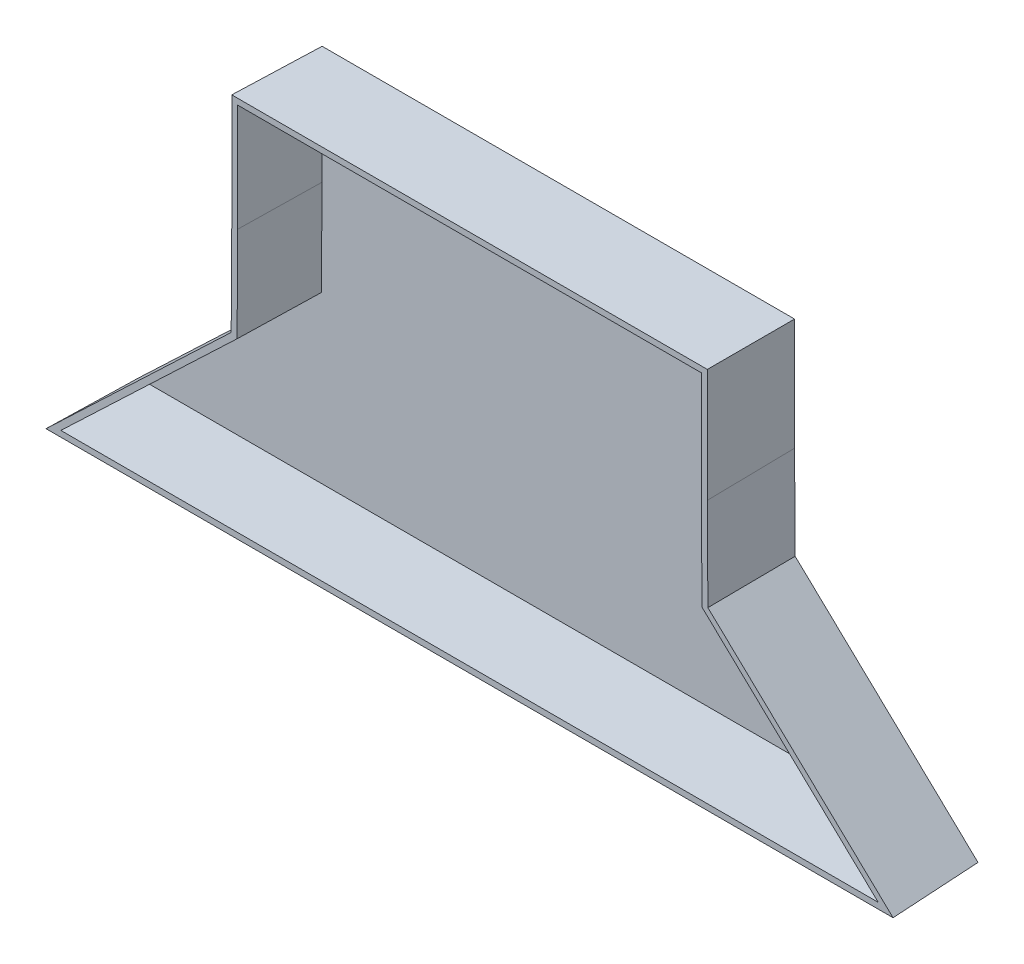
ISO-10303-21;
HEADER;
FILE_DESCRIPTION(('STEP AP214'),'2;1');
FILE_NAME('part.step','',(''),(''),'','','');
FILE_SCHEMA(('AUTOMOTIVE_DESIGN { 1 0 10303 214 1 1 1 1 }'));
ENDSEC;
DATA;
#1=APPLICATION_CONTEXT('core data for automotive mechanical design processes');
#2=APPLICATION_PROTOCOL_DEFINITION('international standard','automotive_design',2000,#1);
#3=PRODUCT_CONTEXT('',#1,'mechanical');
#4=PRODUCT('Part','Part','',(#3));
#5=PRODUCT_RELATED_PRODUCT_CATEGORY('part','',(#4));
#6=PRODUCT_DEFINITION_FORMATION('','',#4);
#7=PRODUCT_DEFINITION_CONTEXT('part definition',#1,'design');
#8=PRODUCT_DEFINITION('design','',#6,#7);
#9=PRODUCT_DEFINITION_SHAPE('','',#8);
#10=(LENGTH_UNIT() NAMED_UNIT(*) SI_UNIT(.MILLI.,.METRE.));
#11=(NAMED_UNIT(*) PLANE_ANGLE_UNIT() SI_UNIT($,.RADIAN.));
#12=(NAMED_UNIT(*) SI_UNIT($,.STERADIAN.) SOLID_ANGLE_UNIT());
#13=UNCERTAINTY_MEASURE_WITH_UNIT(LENGTH_MEASURE(1.E-05),#10,'distance_accuracy_value','');
#14=(GEOMETRIC_REPRESENTATION_CONTEXT(3) GLOBAL_UNCERTAINTY_ASSIGNED_CONTEXT((#13)) GLOBAL_UNIT_ASSIGNED_CONTEXT((#10,
#11,#12)) REPRESENTATION_CONTEXT('',''));
#15=CARTESIAN_POINT('',(0.,0.,0.));
#16=DIRECTION('',(0.,0.,1.));
#17=DIRECTION('',(1.,0.,0.));
#18=AXIS2_PLACEMENT_3D('',#15,#16,#17);
#19=CARTESIAN_POINT('',(0.,5.54139653256378,0.));
#20=DIRECTION('',(0.,-0.999847695156391,-0.0174524064372836));
#21=DIRECTION('',(0.,0.0174524064372836,-0.999847695156391));
#22=AXIS2_PLACEMENT_3D('',#19,#20,#21);
#23=PLANE('',#22);
#24=DIRECTION('',(1.,0.,0.));
#25=VECTOR('',#24,1.);
#26=CARTESIAN_POINT('',(0.,5.54139653256378,0.));
#27=LINE('',#26,#25);
#28=CARTESIAN_POINT('',(23.7821540360607,5.54139653256379,0.));
#29=VERTEX_POINT('',#28);
#30=CARTESIAN_POINT('',(165.552936780201,5.5413965325638,0.));
#31=VERTEX_POINT('',#30);
#32=EDGE_CURVE('E164',#29,#31,#27,.T.);
#33=ORIENTED_EDGE('',*,*,#32,.T.);
#34=DIRECTION('',(0.0436637861357693,-0.0174357617648877,0.998894122513476));
#35=VECTOR('',#34,1.);
#36=CARTESIAN_POINT('',(165.237305765479,5.66743386613772,-7.22067400449202));
#37=LINE('',#36,#35);
#38=CARTESIAN_POINT('',(166.208618676084,5.27957055864056,15.));
#39=VERTEX_POINT('',#38);
#40=EDGE_CURVE('E11',#39,#31,#37,.F.);
#41=ORIENTED_EDGE('',*,*,#40,.F.);
#42=DIRECTION('',(-1.,0.,0.));
#43=VECTOR('',#42,1.);
#44=CARTESIAN_POINT('',(0.,5.27957055864052,15.));
#45=LINE('',#44,#43);
#46=CARTESIAN_POINT('',(23.1264721401771,5.27957055864052,15.));
#47=VERTEX_POINT('',#46);
#48=EDGE_CURVE('E245',#47,#39,#45,.F.);
#49=ORIENTED_EDGE('',*,*,#48,.F.);
#50=DIRECTION('',(0.0436637861357693,0.0174357617648877,-0.998894122513476));
#51=VECTOR('',#50,1.);
#52=CARTESIAN_POINT('',(23.7368127358297,5.52329090822607,1.03727052360901));
#53=LINE('',#52,#51);
#54=EDGE_CURVE('E247',#47,#29,#53,.T.);
#55=ORIENTED_EDGE('',*,*,#54,.T.);
#56=EDGE_LOOP('',(#33,#41,#49,#55));
#57=FACE_BOUND('',#56,.T.);
#58=ADVANCED_FACE('F39',(#57),#23,.T.);
#59=CARTESIAN_POINT('',(81.3137707494737,85.5806071155987,0.));
#60=DIRECTION('',(0.688698845925641,0.72483743910634,-0.0174524064372836));
#61=DIRECTION('',(-0.72494785217559,0.688803754073683,0.));
#62=AXIS2_PLACEMENT_3D('',#59,#60,#61);
#63=PLANE('',#62);
#64=DIRECTION('',(0.72494785217559,-0.688803754073683,0.));
#65=VECTOR('',#64,1.);
#66=CARTESIAN_POINT('',(81.3137707494737,85.5806071155987,0.));
#67=LINE('',#66,#65);
#68=CARTESIAN_POINT('',(134.667545408131,34.8869190543189,0.));
#69=VERTEX_POINT('',#68);
#70=EDGE_CURVE('E227',#69,#31,#67,.T.);
#71=ORIENTED_EDGE('',*,*,#70,.F.);
#72=DIRECTION('',(0.0174049854885636,0.007536136230184,0.999820120387094));
#73=VECTOR('',#72,1.);
#74=CARTESIAN_POINT('',(134.663145120395,34.8850137859777,-0.25277218511028));
#75=LINE('',#74,#73);
#76=CARTESIAN_POINT('',(134.928667160939,34.9999814353889,15.));
#77=VERTEX_POINT('',#76);
#78=EDGE_CURVE('E48',#77,#69,#75,.F.);
#79=ORIENTED_EDGE('',*,*,#78,.F.);
#80=DIRECTION('',(0.72494785217559,-0.688803754073683,0.));
#81=VECTOR('',#80,1.);
#82=CARTESIAN_POINT('',(81.494117463226,85.7704172930381,15.));
#83=LINE('',#82,#81);
#84=EDGE_CURVE('E263',#77,#39,#83,.T.);
#85=ORIENTED_EDGE('',*,*,#84,.T.);
#86=ORIENTED_EDGE('',*,*,#40,.T.);
#87=EDGE_LOOP('',(#71,#79,#85,#86));
#88=FACE_BOUND('',#87,.T.);
#89=ADVANCED_FACE('F41',(#88),#63,.T.);
#90=CARTESIAN_POINT('',(134.881122806116,0.846269372514969,0.));
#91=DIRECTION('',(0.9998280160246,0.00627310783111053,-0.0174524064372836));
#92=DIRECTION('',(-0.0174527498399369,0.,-0.999847689162217));
#93=AXIS2_PLACEMENT_3D('',#90,#91,#92);
#94=PLANE('',#93);
#95=DIRECTION('',(-0.00627406340135567,0.999980317870525,0.));
#96=VECTOR('',#95,1.);
#97=CARTESIAN_POINT('',(134.881122806116,0.846269372514969,0.));
#98=LINE('',#97,#96);
#99=CARTESIAN_POINT('',(134.568658858887,50.6477739612299,0.));
#100=VERTEX_POINT('',#99);
#101=EDGE_CURVE('E230',#69,#100,#98,.T.);
#102=ORIENTED_EDGE('',*,*,#101,.T.);
#103=DIRECTION('',(-0.0174524064111269,-5.47492909557997E-05,-0.999847693657877));
#104=VECTOR('',#103,1.);
#105=CARTESIAN_POINT('',(134.568706445504,50.6477741105114,0.00272623544489111));
#106=LINE('',#105,#104);
#107=CARTESIAN_POINT('',(134.83048483281,50.6485953256926,15.));
#108=VERTEX_POINT('',#107);
#109=EDGE_CURVE('E258',#108,#100,#106,.T.);
#110=ORIENTED_EDGE('',*,*,#109,.F.);
#111=DIRECTION('',(0.00627406340135566,-0.999980317870525,0.));
#112=VECTOR('',#111,1.);
#113=CARTESIAN_POINT('',(135.142943626746,0.847912085275486,15.));
#114=LINE('',#113,#112);
#115=EDGE_CURVE('E266',#77,#108,#114,.F.);
#116=ORIENTED_EDGE('',*,*,#115,.F.);
#117=ORIENTED_EDGE('',*,*,#78,.T.);
#118=EDGE_LOOP('',(#102,#110,#116,#117));
#119=FACE_BOUND('',#118,.T.);
#120=ADVANCED_FACE('F303',(#119),#94,.T.);
#121=CARTESIAN_POINT('',(134.568658858887,0.,0.));
#122=DIRECTION('',(0.999847695156391,0.,-0.0174524064372836));
#123=DIRECTION('',(-0.0174524064372836,0.,-0.999847695156391));
#124=AXIS2_PLACEMENT_3D('',#121,#122,#123);
#125=PLANE('',#124);
#126=DIRECTION('',(0.,1.,0.));
#127=VECTOR('',#126,1.);
#128=CARTESIAN_POINT('',(134.568658858887,0.,0.));
#129=LINE('',#128,#127);
#130=CARTESIAN_POINT('',(134.568658858887,69.5413965325638,0.));
#131=VERTEX_POINT('',#130);
#132=EDGE_CURVE('E232',#100,#131,#129,.T.);
#133=ORIENTED_EDGE('',*,*,#132,.T.);
#134=DIRECTION('',(0.0174497491606827,0.0174497491606827,0.999695459881887));
#135=VECTOR('',#134,1.);
#136=CARTESIAN_POINT('',(134.547483938571,69.5202216122475,-1.21311037245689));
#137=LINE('',#136,#135);
#138=CARTESIAN_POINT('',(134.83048483281,69.8032225064871,15.));
#139=VERTEX_POINT('',#138);
#140=EDGE_CURVE('E256',#139,#131,#137,.F.);
#141=ORIENTED_EDGE('',*,*,#140,.F.);
#142=DIRECTION('',(0.,-1.,0.));
#143=VECTOR('',#142,1.);
#144=CARTESIAN_POINT('',(134.83048483281,0.,15.));
#145=LINE('',#144,#143);
#146=EDGE_CURVE('E268',#108,#139,#145,.F.);
#147=ORIENTED_EDGE('',*,*,#146,.F.);
#148=ORIENTED_EDGE('',*,*,#109,.T.);
#149=EDGE_LOOP('',(#133,#141,#147,#148));
#150=FACE_BOUND('',#149,.T.);
#151=ADVANCED_FACE('F308',(#150),#125,.T.);
#152=CARTESIAN_POINT('',(0.,69.5413965325638,0.));
#153=DIRECTION('',(0.,0.999847695156391,-0.0174524064372836));
#154=DIRECTION('',(0.,0.0174524064372836,0.999847695156391));
#155=AXIS2_PLACEMENT_3D('',#152,#153,#154);
#156=PLANE('',#155);
#157=DIRECTION('',(1.,0.,0.));
#158=VECTOR('',#157,1.);
#159=CARTESIAN_POINT('',(0.,69.5413965325638,0.));
#160=LINE('',#159,#158);
#161=CARTESIAN_POINT('',(54.7664319573739,69.5413965325638,0.));
#162=VERTEX_POINT('',#161);
#163=EDGE_CURVE('E235',#162,#131,#160,.T.);
#164=ORIENTED_EDGE('',*,*,#163,.F.);
#165=DIRECTION('',(0.0174497491606828,-0.0174497491606827,-0.999695459881887));
#166=VECTOR('',#165,1.);
#167=CARTESIAN_POINT('',(54.7876068776903,69.5202216122475,-1.21311037245689));
#168=LINE('',#167,#166);
#169=CARTESIAN_POINT('',(54.5046059834507,69.8032225064871,15.));
#170=VERTEX_POINT('',#169);
#171=EDGE_CURVE('E254',#170,#162,#168,.T.);
#172=ORIENTED_EDGE('',*,*,#171,.F.);
#173=DIRECTION('',(1.,0.,0.));
#174=VECTOR('',#173,1.);
#175=CARTESIAN_POINT('',(0.,69.8032225064871,15.));
#176=LINE('',#175,#174);
#177=EDGE_CURVE('E270',#170,#139,#176,.T.);
#178=ORIENTED_EDGE('',*,*,#177,.T.);
#179=ORIENTED_EDGE('',*,*,#140,.T.);
#180=EDGE_LOOP('',(#164,#172,#178,#179));
#181=FACE_BOUND('',#180,.T.);
#182=ADVANCED_FACE('F310',(#181),#156,.T.);
#183=CARTESIAN_POINT('',(54.766431957374,0.,0.));
#184=DIRECTION('',(-0.999847695156391,0.,-0.0174524064372836));
#185=DIRECTION('',(-0.0174524064372836,0.,0.999847695156391));
#186=AXIS2_PLACEMENT_3D('',#183,#184,#185);
#187=PLANE('',#186);
#188=DIRECTION('',(0.,1.,0.));
#189=VECTOR('',#188,1.);
#190=CARTESIAN_POINT('',(54.766431957374,0.,0.));
#191=LINE('',#190,#189);
#192=CARTESIAN_POINT('',(54.7664319573739,50.6477739612299,0.));
#193=VERTEX_POINT('',#192);
#194=EDGE_CURVE('E238',#193,#162,#191,.T.);
#195=ORIENTED_EDGE('',*,*,#194,.F.);
#196=DIRECTION('',(0.0174524064111269,-5.47492909558061E-05,-0.999847693657877));
#197=VECTOR('',#196,1.);
#198=CARTESIAN_POINT('',(54.7664803516703,50.6477738094151,-0.0027725073780871));
#199=LINE('',#198,#197);
#200=CARTESIAN_POINT('',(54.5046059834507,50.6485953256944,15.));
#201=VERTEX_POINT('',#200);
#202=EDGE_CURVE('E252',#201,#193,#199,.T.);
#203=ORIENTED_EDGE('',*,*,#202,.F.);
#204=DIRECTION('',(0.,1.,0.));
#205=VECTOR('',#204,1.);
#206=CARTESIAN_POINT('',(54.5046059834508,0.,15.));
#207=LINE('',#206,#205);
#208=EDGE_CURVE('E273',#201,#170,#207,.T.);
#209=ORIENTED_EDGE('',*,*,#208,.T.);
#210=ORIENTED_EDGE('',*,*,#171,.T.);
#211=EDGE_LOOP('',(#195,#203,#209,#210));
#212=FACE_BOUND('',#211,.T.);
#213=ADVANCED_FACE('F285',(#212),#187,.T.);
#214=CARTESIAN_POINT('',(54.4465150479482,-0.341607610958801,0.));
#215=DIRECTION('',(-0.9998280160246,0.00627310783110833,-0.0174524064372836));
#216=DIRECTION('',(-0.0174527498399369,0.,0.999847689162217));
#217=AXIS2_PLACEMENT_3D('',#214,#215,#216);
#218=PLANE('',#217);
#219=DIRECTION('',(0.00627406340135346,0.999980317870525,0.));
#220=VECTOR('',#219,1.);
#221=CARTESIAN_POINT('',(54.4465150479482,-0.341607610958801,0.));
#222=LINE('',#221,#220);
#223=CARTESIAN_POINT('',(54.6675454081306,34.8869190543188,0.));
#224=VERTEX_POINT('',#223);
#225=EDGE_CURVE('E241',#224,#193,#222,.T.);
#226=ORIENTED_EDGE('',*,*,#225,.F.);
#227=DIRECTION('',(-0.0174049854885636,0.00753613623018398,0.999820120387094));
#228=VECTOR('',#227,1.);
#229=CARTESIAN_POINT('',(54.6593163410392,34.890482135178,0.472714375742639));
#230=LINE('',#229,#228);
#231=CARTESIAN_POINT('',(54.4064236553223,34.9999814353889,15.));
#232=VERTEX_POINT('',#231);
#233=EDGE_CURVE('E250',#232,#224,#230,.F.);
#234=ORIENTED_EDGE('',*,*,#233,.F.);
#235=DIRECTION('',(0.00627406340135346,0.999980317870525,0.));
#236=VECTOR('',#235,1.);
#237=CARTESIAN_POINT('',(54.1846942273177,-0.339964898198285,15.));
#238=LINE('',#237,#236);
#239=EDGE_CURVE('E275',#232,#201,#238,.T.);
#240=ORIENTED_EDGE('',*,*,#239,.T.);
#241=ORIENTED_EDGE('',*,*,#202,.T.);
#242=EDGE_LOOP('',(#226,#234,#240,#241));
#243=FACE_BOUND('',#242,.T.);
#244=ADVANCED_FACE('F279',(#243),#218,.T.);
#245=CARTESIAN_POINT('',(8.51637889056541,-8.96326500620159,0.));
#246=DIRECTION('',(-0.688698845925642,0.72483743910634,-0.0174524064372836));
#247=DIRECTION('',(-0.72494785217559,-0.688803754073683,0.));
#248=AXIS2_PLACEMENT_3D('',#245,#246,#247);
#249=PLANE('',#248);
#250=DIRECTION('',(-0.72494785217559,-0.688803754073683,0.));
#251=VECTOR('',#250,1.);
#252=CARTESIAN_POINT('',(8.51637889056541,-8.96326500620159,0.));
#253=LINE('',#252,#251);
#254=EDGE_CURVE('E244',#224,#29,#253,.T.);
#255=ORIENTED_EDGE('',*,*,#254,.T.);
#256=ORIENTED_EDGE('',*,*,#54,.F.);
#257=DIRECTION('',(0.72494785217559,0.688803754073683,0.));
#258=VECTOR('',#257,1.);
#259=CARTESIAN_POINT('',(8.33603217681307,-8.77345482876214,15.));
#260=LINE('',#259,#258);
#261=EDGE_CURVE('E43',#232,#47,#260,.F.);
#262=ORIENTED_EDGE('',*,*,#261,.F.);
#263=ORIENTED_EDGE('',*,*,#233,.T.);
#264=EDGE_LOOP('',(#255,#256,#262,#263));
#265=FACE_BOUND('',#264,.T.);
#266=ADVANCED_FACE('F292',(#265),#249,.T.);
#267=CARTESIAN_POINT('',(0.,0.,15.));
#268=DIRECTION('',(0.,0.,1.));
#269=DIRECTION('',(1.,0.,0.));
#270=AXIS2_PLACEMENT_3D('',#267,#268,#269);
#271=PLANE('',#270);
#272=DIRECTION('',(-1.,0.,0.));
#273=VECTOR('',#272,1.);
#274=CARTESIAN_POINT('',(0.,6.27972288668443,15.));
#275=LINE('',#274,#273);
#276=CARTESIAN_POINT('',(25.631119653935,6.27972288668443,15.));
#277=VERTEX_POINT('',#276);
#278=CARTESIAN_POINT('',(163.703971162326,6.27972288668447,15.));
#279=VERTEX_POINT('',#278);
#280=EDGE_CURVE('E159',#277,#279,#275,.F.);
#281=ORIENTED_EDGE('',*,*,#280,.F.);
#282=DIRECTION('',(0.72494785217559,0.688803754073683,0.));
#283=VECTOR('',#282,1.);
#284=CARTESIAN_POINT('',(9.02494085501525,-9.49851311082598,15.));
#285=LINE('',#284,#283);
#286=CARTESIAN_POINT('',(55.4038859202794,34.5680930251329,15.));
#287=VERTEX_POINT('',#286);
#288=EDGE_CURVE('E223',#287,#277,#285,.F.);
#289=ORIENTED_EDGE('',*,*,#288,.F.);
#290=DIRECTION('',(0.00627406340135346,0.999980317870525,0.));
#291=VECTOR('',#290,1.);
#292=CARTESIAN_POINT('',(55.1848268702339,-0.346239917315444,15.));
#293=LINE('',#292,#291);
#294=CARTESIAN_POINT('',(55.5047583114946,50.6454577852587,15.));
#295=VERTEX_POINT('',#294);
#296=EDGE_CURVE('E56',#287,#295,#293,.T.);
#297=ORIENTED_EDGE('',*,*,#296,.T.);
#298=DIRECTION('',(0.,1.,0.));
#299=VECTOR('',#298,1.);
#300=CARTESIAN_POINT('',(55.5047583114947,0.,15.));
#301=LINE('',#300,#299);
#302=CARTESIAN_POINT('',(55.5047583114946,68.8030701784431,15.));
#303=VERTEX_POINT('',#302);
#304=EDGE_CURVE('E219',#295,#303,#301,.T.);
#305=ORIENTED_EDGE('',*,*,#304,.T.);
#306=DIRECTION('',(1.,0.,0.));
#307=VECTOR('',#306,1.);
#308=CARTESIAN_POINT('',(0.,68.8030701784431,15.));
#309=LINE('',#308,#307);
#310=CARTESIAN_POINT('',(133.830332504767,68.8030701784431,15.));
#311=VERTEX_POINT('',#310);
#312=EDGE_CURVE('E216',#303,#311,#309,.T.);
#313=ORIENTED_EDGE('',*,*,#312,.T.);
#314=DIRECTION('',(0.,-1.,0.));
#315=VECTOR('',#314,1.);
#316=CARTESIAN_POINT('',(133.830332504767,0.,15.));
#317=LINE('',#316,#315);
#318=CARTESIAN_POINT('',(133.830332504767,50.645457785258,15.));
#319=VERTEX_POINT('',#318);
#320=EDGE_CURVE('E214',#319,#311,#317,.F.);
#321=ORIENTED_EDGE('',*,*,#320,.F.);
#322=DIRECTION('',(0.00627406340135566,-0.999980317870525,0.));
#323=VECTOR('',#322,1.);
#324=CARTESIAN_POINT('',(134.14281098383,0.841637066158325,15.));
#325=LINE('',#324,#323);
#326=CARTESIAN_POINT('',(133.931204895982,34.5680930251329,15.));
#327=VERTEX_POINT('',#326);
#328=EDGE_CURVE('E212',#327,#319,#325,.F.);
#329=ORIENTED_EDGE('',*,*,#328,.F.);
#330=DIRECTION('',(0.72494785217559,-0.688803754073683,0.));
#331=VECTOR('',#330,1.);
#332=CARTESIAN_POINT('',(80.8052087850239,85.0453590109743,15.));
#333=LINE('',#332,#331);
#334=EDGE_CURVE('E210',#327,#279,#333,.T.);
#335=ORIENTED_EDGE('',*,*,#334,.T.);
#336=EDGE_LOOP('',(#281,#289,#297,#305,#313,#321,#329,#335));
#337=FACE_BOUND('',#336,.T.);
#338=ORIENTED_EDGE('',*,*,#48,.T.);
#339=ORIENTED_EDGE('',*,*,#84,.F.);
#340=ORIENTED_EDGE('',*,*,#115,.T.);
#341=ORIENTED_EDGE('',*,*,#146,.T.);
#342=ORIENTED_EDGE('',*,*,#177,.F.);
#343=ORIENTED_EDGE('',*,*,#208,.F.);
#344=ORIENTED_EDGE('',*,*,#239,.F.);
#345=ORIENTED_EDGE('',*,*,#261,.T.);
#346=EDGE_LOOP('',(#338,#339,#340,#341,#342,#343,#344,#345));
#347=FACE_BOUND('',#346,.T.);
#348=ADVANCED_FACE('F282',(#337,#347),#271,.T.);
#349=CARTESIAN_POINT('',(0.,0.,0.));
#350=DIRECTION('',(0.,0.,1.));
#351=DIRECTION('',(1.,0.,0.));
#352=AXIS2_PLACEMENT_3D('',#349,#350,#351);
#353=PLANE('',#352);
#354=ORIENTED_EDGE('',*,*,#32,.F.);
#355=ORIENTED_EDGE('',*,*,#254,.F.);
#356=ORIENTED_EDGE('',*,*,#225,.T.);
#357=ORIENTED_EDGE('',*,*,#194,.T.);
#358=ORIENTED_EDGE('',*,*,#163,.T.);
#359=ORIENTED_EDGE('',*,*,#132,.F.);
#360=ORIENTED_EDGE('',*,*,#101,.F.);
#361=ORIENTED_EDGE('',*,*,#70,.T.);
#362=EDGE_LOOP('',(#354,#355,#356,#357,#358,#359,#360,#361));
#363=FACE_BOUND('',#362,.T.);
#364=ADVANCED_FACE('F290',(#363),#353,.F.);
#365=CARTESIAN_POINT('',(0.,6.54124422772017,0.0174524064372836));
#366=DIRECTION('',(0.,-0.999847695156391,-0.0174524064372836));
#367=DIRECTION('',(0.,0.0174524064372836,-0.999847695156391));
#368=AXIS2_PLACEMENT_3D('',#365,#366,#367);
#369=PLANE('',#368);
#370=DIRECTION('',(-1.,0.,0.));
#371=VECTOR('',#370,1.);
#372=CARTESIAN_POINT('',(0.,6.52409379567947,1.));
#373=LINE('',#372,#371);
#374=CARTESIAN_POINT('',(26.2430894234263,6.52409379567948,1.));
#375=VERTEX_POINT('',#374);
#376=CARTESIAN_POINT('',(163.092001392835,6.52409379567951,1.));
#377=VERTEX_POINT('',#376);
#378=EDGE_CURVE('E157',#375,#377,#373,.F.);
#379=ORIENTED_EDGE('',*,*,#378,.F.);
#380=DIRECTION('',(0.0436637861357693,0.0174357617648877,-0.998894122513476));
#381=VECTOR('',#380,1.);
#382=CARTESIAN_POINT('',(26.2359236460896,6.52123236753593,1.16393110855332));
#383=LINE('',#382,#381);
#384=EDGE_CURVE('E184',#277,#375,#383,.T.);
#385=ORIENTED_EDGE('',*,*,#384,.F.);
#386=ORIENTED_EDGE('',*,*,#280,.T.);
#387=DIRECTION('',(0.0436637861357693,-0.0174357617648877,0.998894122513476));
#388=VECTOR('',#387,1.);
#389=CARTESIAN_POINT('',(162.738194855219,6.66537532544758,-7.09401341954771));
#390=LINE('',#389,#388);
#391=EDGE_CURVE('E153',#279,#377,#390,.F.);
#392=ORIENTED_EDGE('',*,*,#391,.T.);
#393=EDGE_LOOP('',(#379,#385,#386,#392));
#394=FACE_BOUND('',#393,.T.);
#395=ADVANCED_FACE('F155',(#394),#369,.F.);
#396=CARTESIAN_POINT('',(80.625071903548,84.8557696764923,0.0174524064372836));
#397=DIRECTION('',(0.688698845925641,0.72483743910634,-0.0174524064372836));
#398=DIRECTION('',(-0.72494785217559,0.688803754073683,0.));
#399=AXIS2_PLACEMENT_3D('',#396,#397,#398);
#400=PLANE('',#399);
#401=DIRECTION('',(0.72494785217559,-0.688803754073683,0.));
#402=VECTOR('',#401,1.);
#403=CARTESIAN_POINT('',(80.6368851855217,84.8682028453641,1.));
#404=LINE('',#403,#402);
#405=CARTESIAN_POINT('',(133.687491260027,34.4625681361341,1.));
#406=VERTEX_POINT('',#405);
#407=EDGE_CURVE('E170',#406,#377,#404,.T.);
#408=ORIENTED_EDGE('',*,*,#407,.T.);
#409=ORIENTED_EDGE('',*,*,#391,.F.);
#410=ORIENTED_EDGE('',*,*,#334,.F.);
#411=DIRECTION('',(0.0174049854885636,0.007536136230184,0.999820120387094));
#412=VECTOR('',#411,1.);
#413=CARTESIAN_POINT('',(133.666041669415,34.4532807375873,-0.23216030729104));
#414=LINE('',#413,#412);
#415=EDGE_CURVE('E165',#327,#406,#414,.F.);
#416=ORIENTED_EDGE('',*,*,#415,.T.);
#417=EDGE_LOOP('',(#408,#409,#410,#416));
#418=FACE_BOUND('',#417,.T.);
#419=ADVANCED_FACE('F176',(#418),#400,.F.);
#420=CARTESIAN_POINT('',(133.881294790091,0.839996264683859,0.0174524064372836));
#421=DIRECTION('',(0.9998280160246,0.00627310783111053,-0.0174524064372836));
#422=DIRECTION('',(-0.0174527498399369,0.,-0.999847689162217));
#423=AXIS2_PLACEMENT_3D('',#420,#421,#422);
#424=PLANE('',#423);
#425=DIRECTION('',(0.00627406340135566,-0.999980317870525,0.));
#426=VECTOR('',#425,1.);
#427=CARTESIAN_POINT('',(133.898444884575,0.840103867581843,1.));
#428=LINE('',#427,#426);
#429=CARTESIAN_POINT('',(133.585961595772,50.6446911784255,1.));
#430=VERTEX_POINT('',#429);
#431=EDGE_CURVE('E178',#406,#430,#428,.F.);
#432=ORIENTED_EDGE('',*,*,#431,.F.);
#433=ORIENTED_EDGE('',*,*,#415,.F.);
#434=ORIENTED_EDGE('',*,*,#328,.T.);
#435=DIRECTION('',(-0.0174524064111269,-5.47492909557997E-05,-0.999847693657877));
#436=VECTOR('',#435,1.);
#437=CARTESIAN_POINT('',(133.568858753345,50.6446375257387,0.0201788135818127));
#438=LINE('',#437,#436);
#439=EDGE_CURVE('E185',#319,#430,#438,.T.);
#440=ORIENTED_EDGE('',*,*,#439,.T.);
#441=EDGE_LOOP('',(#432,#433,#434,#440));
#442=FACE_BOUND('',#441,.T.);
#443=ADVANCED_FACE('F361',(#442),#424,.F.);
#444=CARTESIAN_POINT('',(133.568811163731,0.,0.0174524064372836));
#445=DIRECTION('',(0.999847695156391,0.,-0.0174524064372836));
#446=DIRECTION('',(-0.0174524064372836,0.,-0.999847695156391));
#447=AXIS2_PLACEMENT_3D('',#444,#445,#446);
#448=PLANE('',#447);
#449=DIRECTION('',(0.,-1.,0.));
#450=VECTOR('',#449,1.);
#451=CARTESIAN_POINT('',(133.585961595772,0.,1.));
#452=LINE('',#451,#450);
#453=CARTESIAN_POINT('',(133.585961595772,68.5586992694481,1.));
#454=VERTEX_POINT('',#453);
#455=EDGE_CURVE('E180',#430,#454,#452,.F.);
#456=ORIENTED_EDGE('',*,*,#455,.F.);
#457=ORIENTED_EDGE('',*,*,#439,.F.);
#458=ORIENTED_EDGE('',*,*,#320,.T.);
#459=DIRECTION('',(0.0174497491606827,0.0174497491606827,0.999695459881887));
#460=VECTOR('',#459,1.);
#461=CARTESIAN_POINT('',(133.547940690784,68.520678364461,-1.17821618787954));
#462=LINE('',#461,#460);
#463=EDGE_CURVE('E189',#311,#454,#462,.F.);
#464=ORIENTED_EDGE('',*,*,#463,.T.);
#465=EDGE_LOOP('',(#456,#457,#458,#464));
#466=FACE_BOUND('',#465,.T.);
#467=ADVANCED_FACE('F368',(#466),#448,.F.);
#468=CARTESIAN_POINT('',(0.,68.5415488374074,0.0174524064372836));
#469=DIRECTION('',(0.,0.999847695156391,-0.0174524064372836));
#470=DIRECTION('',(0.,0.0174524064372836,0.999847695156391));
#471=AXIS2_PLACEMENT_3D('',#468,#469,#470);
#472=PLANE('',#471);
#473=DIRECTION('',(1.,0.,0.));
#474=VECTOR('',#473,1.);
#475=CARTESIAN_POINT('',(0.,68.5586992694481,1.));
#476=LINE('',#475,#474);
#477=CARTESIAN_POINT('',(55.7491292204896,68.5586992694481,1.));
#478=VERTEX_POINT('',#477);
#479=EDGE_CURVE('E192',#478,#454,#476,.T.);
#480=ORIENTED_EDGE('',*,*,#479,.T.);
#481=ORIENTED_EDGE('',*,*,#463,.F.);
#482=ORIENTED_EDGE('',*,*,#312,.F.);
#483=DIRECTION('',(0.0174497491606828,-0.0174497491606827,-0.999695459881887));
#484=VECTOR('',#483,1.);
#485=CARTESIAN_POINT('',(55.7871501254767,68.520678364461,-1.17821618787954));
#486=LINE('',#485,#484);
#487=EDGE_CURVE('E194',#303,#478,#486,.T.);
#488=ORIENTED_EDGE('',*,*,#487,.T.);
#489=EDGE_LOOP('',(#480,#481,#482,#488));
#490=FACE_BOUND('',#489,.T.);
#491=ADVANCED_FACE('F376',(#490),#472,.F.);
#492=CARTESIAN_POINT('',(55.7662796525304,0.,0.0174524064372836));
#493=DIRECTION('',(-0.999847695156391,0.,-0.0174524064372836));
#494=DIRECTION('',(-0.0174524064372836,0.,0.999847695156391));
#495=AXIS2_PLACEMENT_3D('',#492,#493,#494);
#496=PLANE('',#495);
#497=DIRECTION('',(0.,1.,0.));
#498=VECTOR('',#497,1.);
#499=CARTESIAN_POINT('',(55.7491292204897,0.,1.));
#500=LINE('',#499,#498);
#501=CARTESIAN_POINT('',(55.7491292204896,50.6446911784262,1.));
#502=VERTEX_POINT('',#501);
#503=EDGE_CURVE('E197',#502,#478,#500,.T.);
#504=ORIENTED_EDGE('',*,*,#503,.T.);
#505=ORIENTED_EDGE('',*,*,#487,.F.);
#506=ORIENTED_EDGE('',*,*,#304,.F.);
#507=DIRECTION('',(0.0174524064111269,-5.47492909558061E-05,-0.999847693657877));
#508=VECTOR('',#507,1.);
#509=CARTESIAN_POINT('',(55.7663280438296,50.6446372246413,0.0146800707588344));
#510=LINE('',#509,#508);
#511=EDGE_CURVE('E199',#295,#502,#510,.T.);
#512=ORIENTED_EDGE('',*,*,#511,.T.);
#513=EDGE_LOOP('',(#504,#505,#506,#512));
#514=FACE_BOUND('',#513,.T.);
#515=ADVANCED_FACE('F384',(#514),#496,.F.);
#516=CARTESIAN_POINT('',(55.4463430639728,-0.347880718789909,0.0174524064372836));
#517=DIRECTION('',(-0.9998280160246,0.00627310783110833,-0.0174524064372836));
#518=DIRECTION('',(-0.0174527498399369,0.,0.999847689162217));
#519=AXIS2_PLACEMENT_3D('',#516,#517,#518);
#520=PLANE('',#519);
#521=DIRECTION('',(0.00627406340135346,0.999980317870525,0.));
#522=VECTOR('',#521,1.);
#523=CARTESIAN_POINT('',(55.4291929694891,-0.347773115891925,1.));
#524=LINE('',#523,#522);
#525=CARTESIAN_POINT('',(55.6475995562338,34.4625681361342,1.));
#526=VERTEX_POINT('',#525);
#527=EDGE_CURVE('E202',#526,#502,#524,.T.);
#528=ORIENTED_EDGE('',*,*,#527,.T.);
#529=ORIENTED_EDGE('',*,*,#511,.F.);
#530=ORIENTED_EDGE('',*,*,#296,.F.);
#531=DIRECTION('',(-0.0174049854885636,0.00753613623018398,0.999820120387094));
#532=VECTOR('',#531,1.);
#533=CARTESIAN_POINT('',(55.6564197920186,34.4587490867876,0.493326253561879));
#534=LINE('',#533,#532);
#535=EDGE_CURVE('E204',#287,#526,#534,.F.);
#536=ORIENTED_EDGE('',*,*,#535,.T.);
#537=EDGE_LOOP('',(#528,#529,#530,#536));
#538=FACE_BOUND('',#537,.T.);
#539=ADVANCED_FACE('F392',(#538),#520,.F.);
#540=CARTESIAN_POINT('',(9.20507773649105,-9.68810244530793,0.0174524064372836));
#541=DIRECTION('',(-0.688698845925642,0.72483743910634,-0.0174524064372836));
#542=DIRECTION('',(-0.72494785217559,-0.688803754073683,0.));
#543=AXIS2_PLACEMENT_3D('',#540,#541,#542);
#544=PLANE('',#543);
#545=DIRECTION('',(0.72494785217559,0.688803754073683,0.));
#546=VECTOR('',#545,1.);
#547=CARTESIAN_POINT('',(9.19326445451743,-9.67566927643614,1.));
#548=LINE('',#547,#546);
#549=EDGE_CURVE('E173',#526,#375,#548,.F.);
#550=ORIENTED_EDGE('',*,*,#549,.F.);
#551=ORIENTED_EDGE('',*,*,#535,.F.);
#552=ORIENTED_EDGE('',*,*,#288,.T.);
#553=ORIENTED_EDGE('',*,*,#384,.T.);
#554=EDGE_LOOP('',(#550,#551,#552,#553));
#555=FACE_BOUND('',#554,.T.);
#556=ADVANCED_FACE('F400',(#555),#544,.F.);
#557=CARTESIAN_POINT('',(0.,0.,1.));
#558=DIRECTION('',(0.,0.,1.));
#559=DIRECTION('',(1.,0.,0.));
#560=AXIS2_PLACEMENT_3D('',#557,#558,#559);
#561=PLANE('',#560);
#562=ORIENTED_EDGE('',*,*,#378,.T.);
#563=ORIENTED_EDGE('',*,*,#407,.F.);
#564=ORIENTED_EDGE('',*,*,#431,.T.);
#565=ORIENTED_EDGE('',*,*,#455,.T.);
#566=ORIENTED_EDGE('',*,*,#479,.F.);
#567=ORIENTED_EDGE('',*,*,#503,.F.);
#568=ORIENTED_EDGE('',*,*,#527,.F.);
#569=ORIENTED_EDGE('',*,*,#549,.T.);
#570=EDGE_LOOP('',(#562,#563,#564,#565,#566,#567,#568,#569));
#571=FACE_BOUND('',#570,.T.);
#572=ADVANCED_FACE('F169',(#571),#561,.T.);
#573=CLOSED_SHELL('',(#58,#89,#120,#151,#182,#213,#244,#266,#348,#364,#395,#419,#443,#467,#491,
#515,#539,#556,#572));
#574=MANIFOLD_SOLID_BREP('B2',#573);
#575=ADVANCED_BREP_SHAPE_REPRESENTATION('',(#18,#574),#14);
#576=SHAPE_DEFINITION_REPRESENTATION(#9,#575);
ENDSEC;
END-ISO-10303-21;
